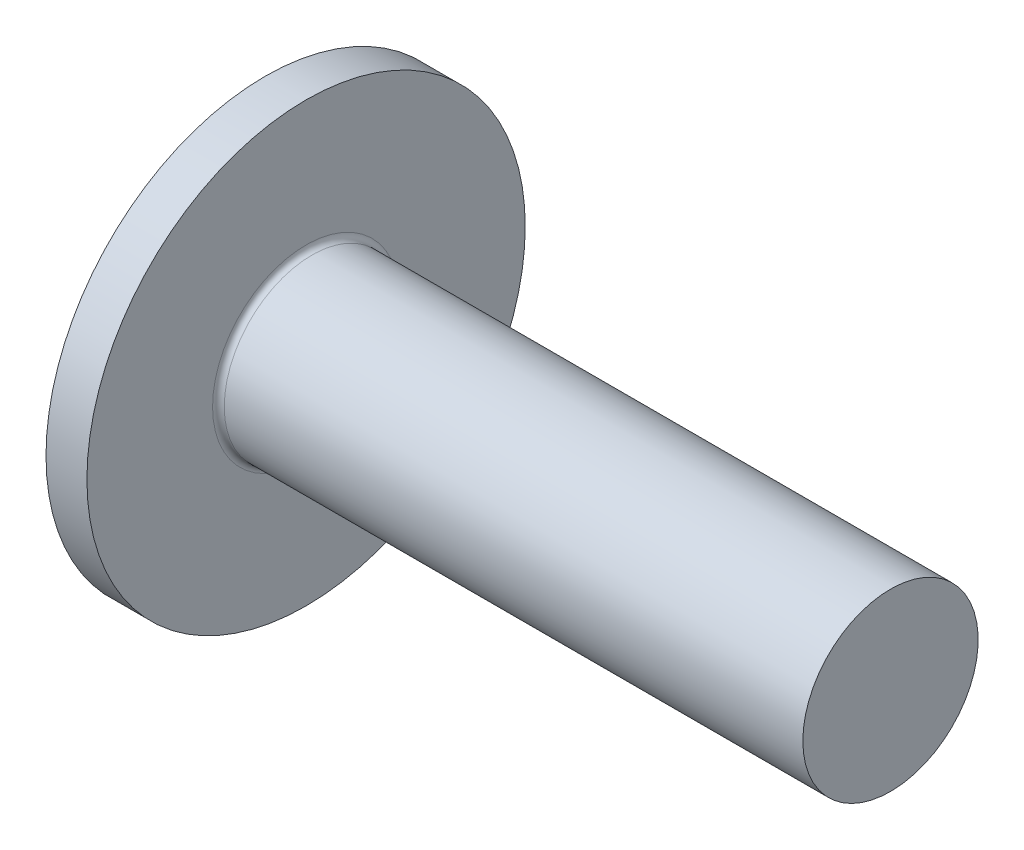
ISO-10303-21;
HEADER;
FILE_DESCRIPTION(('STEP AP214'),'2;1');
FILE_NAME('part.step','',(''),(''),'','','');
FILE_SCHEMA(('AUTOMOTIVE_DESIGN { 1 0 10303 214 1 1 1 1 }'));
ENDSEC;
DATA;
#1=APPLICATION_CONTEXT('core data for automotive mechanical design processes');
#2=APPLICATION_PROTOCOL_DEFINITION('international standard','automotive_design',2000,#1);
#3=PRODUCT_CONTEXT('',#1,'mechanical');
#4=PRODUCT('Part','Part','',(#3));
#5=PRODUCT_RELATED_PRODUCT_CATEGORY('part','',(#4));
#6=PRODUCT_DEFINITION_FORMATION('','',#4);
#7=PRODUCT_DEFINITION_CONTEXT('part definition',#1,'design');
#8=PRODUCT_DEFINITION('design','',#6,#7);
#9=PRODUCT_DEFINITION_SHAPE('','',#8);
#10=(LENGTH_UNIT() NAMED_UNIT(*) SI_UNIT(.MILLI.,.METRE.));
#11=(NAMED_UNIT(*) PLANE_ANGLE_UNIT() SI_UNIT($,.RADIAN.));
#12=(NAMED_UNIT(*) SI_UNIT($,.STERADIAN.) SOLID_ANGLE_UNIT());
#13=UNCERTAINTY_MEASURE_WITH_UNIT(LENGTH_MEASURE(1.E-05),#10,'distance_accuracy_value','');
#14=(GEOMETRIC_REPRESENTATION_CONTEXT(3) GLOBAL_UNCERTAINTY_ASSIGNED_CONTEXT((#13)) GLOBAL_UNIT_ASSIGNED_CONTEXT((#10,
#11,#12)) REPRESENTATION_CONTEXT('',''));
#15=CARTESIAN_POINT('',(0.,0.,0.));
#16=DIRECTION('',(0.,0.,1.));
#17=DIRECTION('',(1.,0.,0.));
#18=AXIS2_PLACEMENT_3D('',#15,#16,#17);
#19=CARTESIAN_POINT('',(1.83,-2.1065246820908,0.37));
#20=DIRECTION('',(0.,0.,1.));
#21=DIRECTION('',(1.,0.,0.));
#22=AXIS2_PLACEMENT_3D('',#19,#20,#21);
#23=PLANE('',#22);
#24=CARTESIAN_POINT('',(-1.32786673493821,-0.897219539779274,0.369999999999999));
#25=CARTESIAN_POINT('',(-1.06109337671331,-0.877038062199218,0.369999999999999));
#26=CARTESIAN_POINT('',(-0.794326989671242,-0.856763698073297,0.369999999999999));
#27=CARTESIAN_POINT('',(-0.260811337761385,-0.815970652270596,0.369999999999999));
#28=CARTESIAN_POINT('',(0.0059379269972715,-0.795451969167194,0.369999999999999));
#29=CARTESIAN_POINT('',(0.539412998487968,-0.754111978403986,0.369999999999999));
#30=CARTESIAN_POINT('',(0.806138805223426,-0.733290670788351,0.37));
#31=CARTESIAN_POINT('',(1.33955859559175,-0.691258233974171,0.37));
#32=CARTESIAN_POINT('',(1.60625257935714,-0.670047106460322,0.37));
#33=CARTESIAN_POINT('',(2.16947783557568,-0.624704906677489,0.37));
#34=CARTESIAN_POINT('',(2.46600421577986,-0.600512950110424,0.37));
#35=CARTESIAN_POINT('',(3.05898099108759,-0.551230034840915,0.37));
#36=CARTESIAN_POINT('',(3.35543138664247,-0.526139081609087,0.37));
#37=CARTESIAN_POINT('',(3.8000230571777,-0.487471420095873,0.370000000000001));
#38=CARTESIAN_POINT('',(3.9482090842122,-0.474410071891181,0.370000000000001));
#39=CARTESIAN_POINT('',(4.24454081077005,-0.447842423983555,0.370000000000001));
#40=CARTESIAN_POINT('',(4.39268651042511,-0.43433612575181,0.370000000000001));
#41=CARTESIAN_POINT('',(4.68892844322179,-0.406748557620104,0.370000000000001));
#42=CARTESIAN_POINT('',(4.83702467507035,-0.392667273720532,0.370000000000001));
#43=CARTESIAN_POINT('',(5.13313852244323,-0.363686294474164,0.370000000000001));
#44=CARTESIAN_POINT('',(5.28115613704917,-0.34878658977029,0.370000000000001));
#45=CARTESIAN_POINT('',(5.42911997966567,-0.333355957600112,0.370000000000001));
#46=B_SPLINE_CURVE_WITH_KNOTS('',3,(#24,#25,#26,#27,#28,#29,#30,#31,#32,#33,#34,#35,#36,#37,#38,
#39,#40,#41,#42,#43,#44,#45),.UNSPECIFIED.,.F.,.F.,(4,2,2,2,2,2,2,2,2,2,4),(0.,
0.802606976261587,1.6052186413846,2.40783018936094,3.21043826948609,4.10297224159249,
4.99550078333373,5.44178186811166,5.88806147744834,6.33435195917925,6.78064754445098),.UNSPECIFIED.);
#47=CARTESIAN_POINT('',(1.83000000000022,-0.65203220416821,0.37));
#48=VERTEX_POINT('',#47);
#49=CARTESIAN_POINT('',(0.101072692651103,-0.788058865154528,0.369999999999999));
#50=VERTEX_POINT('',#49);
#51=EDGE_CURVE('E324',#48,#50,#46,.F.);
#52=ORIENTED_EDGE('',*,*,#51,.F.);
#53=DIRECTION('',(0.,1.,0.));
#54=VECTOR('',#53,1.);
#55=CARTESIAN_POINT('',(1.83,-2.1065246820908,0.37));
#56=LINE('',#55,#54);
#57=CARTESIAN_POINT('',(1.83,-2.1065246820908,0.37));
#58=VERTEX_POINT('',#57);
#59=EDGE_CURVE('E283',#58,#48,#56,.T.);
#60=ORIENTED_EDGE('',*,*,#59,.F.);
#61=DIRECTION('',(0.941259815267089,-0.337683224580915,0.));
#62=VECTOR('',#61,1.);
#63=CARTESIAN_POINT('',(0.,-1.45,0.369999999999999));
#64=LINE('',#63,#62);
#65=CARTESIAN_POINT('',(0.364218312315864,-1.58066574410099,0.369999999999999));
#66=VERTEX_POINT('',#65);
#67=EDGE_CURVE('E269',#66,#58,#64,.T.);
#68=ORIENTED_EDGE('',*,*,#67,.F.);
#69=CARTESIAN_POINT('',(3.8,0.,0.370000000000001));
#70=DIRECTION('',(0.,0.,1.));
#71=DIRECTION('',(1.,0.,0.));
#72=AXIS2_PLACEMENT_3D('',#69,#70,#71);
#73=CIRCLE('',#72,3.78194394458723);
#74=EDGE_CURVE('E207',#50,#66,#73,.T.);
#75=ORIENTED_EDGE('',*,*,#74,.F.);
#76=EDGE_LOOP('',(#52,#60,#68,#75));
#77=FACE_BOUND('',#76,.T.);
#78=ADVANCED_FACE('F33',(#77),#23,.F.);
#79=CARTESIAN_POINT('',(1.83,2.1065246820908,-0.37));
#80=DIRECTION('',(0.,0.,-1.));
#81=DIRECTION('',(-1.,0.,0.));
#82=AXIS2_PLACEMENT_3D('',#79,#80,#81);
#83=PLANE('',#82);
#84=CARTESIAN_POINT('',(-1.32786673493821,-0.897219539779274,-0.37));
#85=CARTESIAN_POINT('',(-1.06109337671331,-0.877038062199217,-0.37));
#86=CARTESIAN_POINT('',(-0.794326989671243,-0.856763698073297,-0.37));
#87=CARTESIAN_POINT('',(-0.260811337761386,-0.815970652270596,-0.37));
#88=CARTESIAN_POINT('',(0.00593792699727101,-0.795451969167194,-0.37));
#89=CARTESIAN_POINT('',(0.539412998487968,-0.754111978403986,-0.37));
#90=CARTESIAN_POINT('',(0.806138805223426,-0.733290670788351,-0.37));
#91=CARTESIAN_POINT('',(1.33955859559175,-0.691258233974171,-0.37));
#92=CARTESIAN_POINT('',(1.60625257935714,-0.670047106460322,-0.370000000000001));
#93=CARTESIAN_POINT('',(2.16947783557568,-0.624704906677489,-0.370000000000001));
#94=CARTESIAN_POINT('',(2.46600421577987,-0.600512950110424,-0.370000000000001));
#95=CARTESIAN_POINT('',(3.05898099108759,-0.551230034840915,-0.370000000000001));
#96=CARTESIAN_POINT('',(3.35543138664247,-0.526139081609087,-0.370000000000001));
#97=CARTESIAN_POINT('',(3.80002305717771,-0.487471420095872,-0.370000000000001));
#98=CARTESIAN_POINT('',(3.9482090842122,-0.47441007189118,-0.370000000000001));
#99=CARTESIAN_POINT('',(4.24454081077005,-0.447842423983555,-0.370000000000001));
#100=CARTESIAN_POINT('',(4.39268651042512,-0.434336125751809,-0.370000000000001));
#101=CARTESIAN_POINT('',(4.68892844322179,-0.406748557620104,-0.370000000000001));
#102=CARTESIAN_POINT('',(4.83702467507035,-0.392667273720532,-0.370000000000001));
#103=CARTESIAN_POINT('',(5.13313852244323,-0.363686294474163,-0.370000000000001));
#104=CARTESIAN_POINT('',(5.28115613704917,-0.348786589770289,-0.370000000000001));
#105=CARTESIAN_POINT('',(5.42911997966567,-0.333355957600112,-0.370000000000001));
#106=B_SPLINE_CURVE_WITH_KNOTS('',3,(#84,#85,#86,#87,#88,#89,#90,#91,#92,#93,#94,#95,#96,#97,
#98,#99,#100,#101,#102,#103,#104,#105),.UNSPECIFIED.,.F.,.F.,(4,2,2,2,2,2,2,2,2,2,4),(0.,
0.802606976261587,1.6052186413846,2.40783018936094,3.21043826948609,4.1029722415925,
4.99550078333373,5.44178186811167,5.88806147744834,6.33435195917925,6.78064754445099),.UNSPECIFIED.);
#107=CARTESIAN_POINT('',(0.101072692651104,-0.788058865154531,-0.37));
#108=VERTEX_POINT('',#107);
#109=CARTESIAN_POINT('',(1.83,-0.652032204167295,-0.370000000000001));
#110=VERTEX_POINT('',#109);
#111=EDGE_CURVE('E316',#108,#110,#106,.T.);
#112=ORIENTED_EDGE('',*,*,#111,.F.);
#113=CARTESIAN_POINT('',(3.8,0.,-0.370000000000001));
#114=DIRECTION('',(0.,0.,-1.));
#115=DIRECTION('',(-1.,0.,0.));
#116=AXIS2_PLACEMENT_3D('',#113,#114,#115);
#117=CIRCLE('',#116,3.78194394458723);
#118=CARTESIAN_POINT('',(0.364218312315864,-1.58066574410099,-0.37));
#119=VERTEX_POINT('',#118);
#120=EDGE_CURVE('E212',#119,#108,#117,.T.);
#121=ORIENTED_EDGE('',*,*,#120,.F.);
#122=DIRECTION('',(0.941259815267089,-0.337683224580915,0.));
#123=VECTOR('',#122,1.);
#124=CARTESIAN_POINT('',(0.,-1.45,-0.37));
#125=LINE('',#124,#123);
#126=CARTESIAN_POINT('',(1.83,-2.1065246820908,-0.370000000000001));
#127=VERTEX_POINT('',#126);
#128=EDGE_CURVE('E272',#119,#127,#125,.T.);
#129=ORIENTED_EDGE('',*,*,#128,.T.);
#130=DIRECTION('',(0.,-1.,0.));
#131=VECTOR('',#130,1.);
#132=CARTESIAN_POINT('',(1.83,2.1065246820908,-0.37));
#133=LINE('',#132,#131);
#134=EDGE_CURVE('E282',#110,#127,#133,.T.);
#135=ORIENTED_EDGE('',*,*,#134,.F.);
#136=EDGE_LOOP('',(#112,#121,#129,#135));
#137=FACE_BOUND('',#136,.T.);
#138=ADVANCED_FACE('F165',(#137),#83,.F.);
#139=CARTESIAN_POINT('',(3.8,0.,0.));
#140=DIRECTION('',(-1.,0.,0.));
#141=DIRECTION('',(0.,1.,0.));
#142=AXIS2_PLACEMENT_3D('',#139,#140,#141);
#143=SPHERICAL_SURFACE('',#142,3.8);
#144=CARTESIAN_POINT('',(1.65,0.,0.));
#145=DIRECTION('',(1.,0.,0.));
#146=DIRECTION('',(0.,0.,-1.));
#147=AXIS2_PLACEMENT_3D('',#144,#145,#146);
#148=CIRCLE('',#147,3.13328900677866);
#149=CARTESIAN_POINT('',(1.65,0.,-3.13328900677866));
#150=VERTEX_POINT('',#149);
#151=EDGE_CURVE('E305',#150,#150,#148,.F.);
#152=ORIENTED_EDGE('',*,*,#151,.T.);
#153=EDGE_LOOP('',(#152));
#154=FACE_BOUND('',#153,.T.);
#155=CARTESIAN_POINT('',(0.101072692651103,0.,0.));
#156=DIRECTION('',(1.,0.,0.));
#157=DIRECTION('',(0.,0.,-1.));
#158=AXIS2_PLACEMENT_3D('',#155,#156,#157);
#159=CIRCLE('',#158,0.870595643768476);
#160=CARTESIAN_POINT('',(0.101072692651103,-0.369999999999996,-0.788058865154528));
#161=VERTEX_POINT('',#160);
#162=EDGE_CURVE('E310',#161,#108,#159,.F.);
#163=ORIENTED_EDGE('',*,*,#162,.F.);
#164=CARTESIAN_POINT('',(3.8,-0.370000000000001,0.));
#165=DIRECTION('',(0.,-1.,0.));
#166=DIRECTION('',(0.,0.,-1.));
#167=AXIS2_PLACEMENT_3D('',#164,#165,#166);
#168=CIRCLE('',#167,3.78194394458723);
#169=CARTESIAN_POINT('',(0.364218312315864,-0.369999999999994,-1.580665744101));
#170=VERTEX_POINT('',#169);
#171=EDGE_CURVE('E223',#161,#170,#168,.T.);
#172=ORIENTED_EDGE('',*,*,#171,.T.);
#173=CARTESIAN_POINT('',(2.90580705947686,0.,-2.49247762619686));
#174=DIRECTION('',(-0.337683224580915,0.,-0.94125981526709));
#175=DIRECTION('',(-0.94125981526709,0.,0.337683224580915));
#176=AXIS2_PLACEMENT_3D('',#173,#174,#175);
#177=CIRCLE('',#176,2.72543102426509);
#178=CARTESIAN_POINT('',(0.364218312315864,0.370000000000006,-1.58066574410099));
#179=VERTEX_POINT('',#178);
#180=EDGE_CURVE('E46',#170,#179,#177,.T.);
#181=ORIENTED_EDGE('',*,*,#180,.T.);
#182=CARTESIAN_POINT('',(3.8,0.370000000000001,0.));
#183=DIRECTION('',(0.,1.,0.));
#184=DIRECTION('',(0.,0.,1.));
#185=AXIS2_PLACEMENT_3D('',#182,#183,#184);
#186=CIRCLE('',#185,3.78194394458723);
#187=CARTESIAN_POINT('',(0.101072692651103,0.370000000000003,-0.788058865154526));
#188=VERTEX_POINT('',#187);
#189=EDGE_CURVE('E221',#179,#188,#186,.T.);
#190=ORIENTED_EDGE('',*,*,#189,.T.);
#191=CARTESIAN_POINT('',(0.101072692651104,0.788058865154531,-0.37));
#192=VERTEX_POINT('',#191);
#193=EDGE_CURVE('E331',#192,#188,#159,.F.);
#194=ORIENTED_EDGE('',*,*,#193,.F.);
#195=CARTESIAN_POINT('',(0.364218312315865,1.580665744101,-0.37));
#196=VERTEX_POINT('',#195);
#197=EDGE_CURVE('E307',#192,#196,#117,.T.);
#198=ORIENTED_EDGE('',*,*,#197,.T.);
#199=CARTESIAN_POINT('',(2.90580705947687,2.49247762619686,0.));
#200=DIRECTION('',(-0.337683224580915,0.941259815267089,0.));
#201=DIRECTION('',(-0.941259815267089,-0.337683224580915,0.));
#202=AXIS2_PLACEMENT_3D('',#199,#200,#201);
#203=CIRCLE('',#202,2.72543102426509);
#204=CARTESIAN_POINT('',(0.364218312315865,1.580665744101,0.369999999999999));
#205=VERTEX_POINT('',#204);
#206=EDGE_CURVE('E205',#196,#205,#203,.T.);
#207=ORIENTED_EDGE('',*,*,#206,.T.);
#208=CARTESIAN_POINT('',(0.101072692651103,0.788058865154528,0.369999999999999));
#209=VERTEX_POINT('',#208);
#210=EDGE_CURVE('E193',#205,#209,#73,.T.);
#211=ORIENTED_EDGE('',*,*,#210,.T.);
#212=CARTESIAN_POINT('',(0.101072692651105,0.369999999999997,0.788058865154532));
#213=VERTEX_POINT('',#212);
#214=EDGE_CURVE('E203',#213,#209,#159,.F.);
#215=ORIENTED_EDGE('',*,*,#214,.F.);
#216=CARTESIAN_POINT('',(0.364218312315865,0.369999999999994,1.580665744101));
#217=VERTEX_POINT('',#216);
#218=EDGE_CURVE('E240',#213,#217,#186,.T.);
#219=ORIENTED_EDGE('',*,*,#218,.T.);
#220=CARTESIAN_POINT('',(2.90580705947687,0.,2.49247762619686));
#221=DIRECTION('',(-0.337683224580915,0.,0.941259815267089));
#222=DIRECTION('',(0.941259815267089,0.,0.337683224580915));
#223=AXIS2_PLACEMENT_3D('',#220,#221,#222);
#224=CIRCLE('',#223,2.72543102426509);
#225=CARTESIAN_POINT('',(0.364218312315865,-0.370000000000005,1.58066574410099));
#226=VERTEX_POINT('',#225);
#227=EDGE_CURVE('E210',#217,#226,#224,.T.);
#228=ORIENTED_EDGE('',*,*,#227,.T.);
#229=CARTESIAN_POINT('',(0.101072692651104,-0.370000000000002,0.78805886515453));
#230=VERTEX_POINT('',#229);
#231=EDGE_CURVE('E268',#226,#230,#168,.T.);
#232=ORIENTED_EDGE('',*,*,#231,.T.);
#233=EDGE_CURVE('E197',#50,#230,#159,.F.);
#234=ORIENTED_EDGE('',*,*,#233,.F.);
#235=ORIENTED_EDGE('',*,*,#74,.T.);
#236=CARTESIAN_POINT('',(2.90580705947686,-2.49247762619686,0.));
#237=DIRECTION('',(-0.337683224580915,-0.94125981526709,0.));
#238=DIRECTION('',(0.94125981526709,-0.337683224580915,0.));
#239=AXIS2_PLACEMENT_3D('',#236,#237,#238);
#240=CIRCLE('',#239,2.72543102426508);
#241=EDGE_CURVE('E206',#66,#119,#240,.T.);
#242=ORIENTED_EDGE('',*,*,#241,.T.);
#243=ORIENTED_EDGE('',*,*,#120,.T.);
#244=EDGE_LOOP('',(#163,#172,#181,#190,#194,#198,#207,#211,#215,#219,#228,#232,#234,#235,#242,#243));
#245=FACE_BOUND('',#244,.T.);
#246=ADVANCED_FACE('F172',(#154,#245),#143,.T.);
#247=CARTESIAN_POINT('',(-1.32786673493863,0.897219539779306,0.369999999999999));
#248=CARTESIAN_POINT('',(-1.06109337671372,0.877038062199249,0.369999999999999));
#249=CARTESIAN_POINT('',(-0.794326989671651,0.856763698073328,0.369999999999999));
#250=CARTESIAN_POINT('',(-0.260811337761783,0.815970652270626,0.369999999999999));
#251=CARTESIAN_POINT('',(0.00593792699687864,0.795451969167224,0.369999999999999));
#252=CARTESIAN_POINT('',(0.539412998487585,0.754111978404016,0.369999999999999));
#253=CARTESIAN_POINT('',(0.806138805223046,0.733290670788381,0.37));
#254=CARTESIAN_POINT('',(1.33955859559138,0.691258233974201,0.37));
#255=CARTESIAN_POINT('',(1.60625257935677,0.670047106460351,0.37));
#256=CARTESIAN_POINT('',(2.16947783557532,0.624704906677519,0.37));
#257=CARTESIAN_POINT('',(2.4660042157795,0.600512950110454,0.37));
#258=CARTESIAN_POINT('',(3.05898099108723,0.551230034840946,0.37));
#259=CARTESIAN_POINT('',(3.35543138664211,0.526139081609118,0.37));
#260=CARTESIAN_POINT('',(3.80002305717734,0.487471420095904,0.370000000000001));
#261=CARTESIAN_POINT('',(3.94820908421184,0.474410071891213,0.370000000000001));
#262=CARTESIAN_POINT('',(4.24454081076969,0.447842423983588,0.370000000000001));
#263=CARTESIAN_POINT('',(4.39268651042475,0.434336125751843,0.370000000000001));
#264=CARTESIAN_POINT('',(4.68892844322142,0.406748557620138,0.370000000000001));
#265=CARTESIAN_POINT('',(4.83702467506999,0.392667273720567,0.370000000000001));
#266=CARTESIAN_POINT('',(5.13313852244287,0.3636862944742,0.370000000000001));
#267=CARTESIAN_POINT('',(5.28115613704881,0.348786589770327,0.370000000000001));
#268=CARTESIAN_POINT('',(5.42911997966531,0.33335595760015,0.370000000000001));
#269=B_SPLINE_CURVE_WITH_KNOTS('',3,(#247,#248,#249,#250,#251,#252,#253,#254,#255,#256,#257,
#258,#259,#260,#261,#262,#263,#264,#265,#266,#267,#268),.UNSPECIFIED.,.F.,.F.,(4,2,2,2,2,2,2,2,
2,2,4),(0.,0.802606976261603,1.60521864138463,2.40783018936098,3.21043826948614,
4.10297224159255,4.99550078333379,5.44178186811172,5.88806147744839,6.33435195917931,
6.78064754445104),.UNSPECIFIED.);
#270=CARTESIAN_POINT('',(1.83000000000022,0.65203220416821,0.37));
#271=VERTEX_POINT('',#270);
#272=EDGE_CURVE('E191',#209,#271,#269,.T.);
#273=ORIENTED_EDGE('',*,*,#272,.F.);
#274=ORIENTED_EDGE('',*,*,#210,.F.);
#275=DIRECTION('',(0.941259815267089,0.337683224580915,0.));
#276=VECTOR('',#275,1.);
#277=CARTESIAN_POINT('',(0.,1.45,0.369999999999999));
#278=LINE('',#277,#276);
#279=CARTESIAN_POINT('',(1.83,2.1065246820908,0.37));
#280=VERTEX_POINT('',#279);
#281=EDGE_CURVE('E60',#205,#280,#278,.T.);
#282=ORIENTED_EDGE('',*,*,#281,.T.);
#283=EDGE_CURVE('E195',#271,#280,#56,.T.);
#284=ORIENTED_EDGE('',*,*,#283,.F.);
#285=EDGE_LOOP('',(#273,#274,#282,#284));
#286=FACE_BOUND('',#285,.T.);
#287=ADVANCED_FACE('F168',(#286),#23,.F.);
#288=CARTESIAN_POINT('',(-1.32786673493863,0.897219539779306,-0.37));
#289=CARTESIAN_POINT('',(-1.06109337671372,0.877038062199249,-0.37));
#290=CARTESIAN_POINT('',(-0.79432698967165,0.856763698073328,-0.37));
#291=CARTESIAN_POINT('',(-0.260811337761783,0.815970652270626,-0.37));
#292=CARTESIAN_POINT('',(0.00593792699687907,0.795451969167224,-0.37));
#293=CARTESIAN_POINT('',(0.539412998487585,0.754111978404016,-0.37));
#294=CARTESIAN_POINT('',(0.806138805223047,0.73329067078838,-0.37));
#295=CARTESIAN_POINT('',(1.33955859559138,0.6912582339742,-0.37));
#296=CARTESIAN_POINT('',(1.60625257935677,0.670047106460351,-0.37));
#297=CARTESIAN_POINT('',(2.16947783557532,0.624704906677519,-0.37));
#298=CARTESIAN_POINT('',(2.4660042157795,0.600512950110454,-0.370000000000001));
#299=CARTESIAN_POINT('',(3.05898099108723,0.551230034840946,-0.370000000000001));
#300=CARTESIAN_POINT('',(3.3554313866421,0.526139081609118,-0.370000000000001));
#301=CARTESIAN_POINT('',(3.80002305717734,0.487471420095904,-0.370000000000001));
#302=CARTESIAN_POINT('',(3.94820908421183,0.474410071891213,-0.370000000000001));
#303=CARTESIAN_POINT('',(4.24454081076968,0.447842423983588,-0.370000000000001));
#304=CARTESIAN_POINT('',(4.39268651042475,0.434336125751843,-0.370000000000001));
#305=CARTESIAN_POINT('',(4.68892844322142,0.406748557620138,-0.370000000000001));
#306=CARTESIAN_POINT('',(4.83702467506998,0.392667273720567,-0.370000000000001));
#307=CARTESIAN_POINT('',(5.13313852244286,0.3636862944742,-0.370000000000001));
#308=CARTESIAN_POINT('',(5.28115613704881,0.348786589770327,-0.370000000000001));
#309=CARTESIAN_POINT('',(5.42911997966531,0.33335595760015,-0.370000000000001));
#310=B_SPLINE_CURVE_WITH_KNOTS('',3,(#288,#289,#290,#291,#292,#293,#294,#295,#296,#297,#298,
#299,#300,#301,#302,#303,#304,#305,#306,#307,#308,#309),.UNSPECIFIED.,.F.,.F.,(4,2,2,2,2,2,2,2,
2,2,4),(0.,0.802606976261603,1.60521864138463,2.40783018936098,3.21043826948614,
4.10297224159255,4.99550078333379,5.44178186811172,5.88806147744839,6.3343519591793,
6.78064754445104),.UNSPECIFIED.);
#311=CARTESIAN_POINT('',(1.83,0.652032204167295,-0.37));
#312=VERTEX_POINT('',#311);
#313=EDGE_CURVE('E340',#312,#192,#310,.F.);
#314=ORIENTED_EDGE('',*,*,#313,.F.);
#315=CARTESIAN_POINT('',(1.83,2.1065246820908,-0.37));
#316=VERTEX_POINT('',#315);
#317=EDGE_CURVE('E284',#316,#312,#133,.T.);
#318=ORIENTED_EDGE('',*,*,#317,.F.);
#319=DIRECTION('',(0.941259815267089,0.337683224580915,0.));
#320=VECTOR('',#319,1.);
#321=CARTESIAN_POINT('',(0.,1.45,-0.37));
#322=LINE('',#321,#320);
#323=EDGE_CURVE('E276',#196,#316,#322,.T.);
#324=ORIENTED_EDGE('',*,*,#323,.F.);
#325=ORIENTED_EDGE('',*,*,#197,.F.);
#326=EDGE_LOOP('',(#314,#318,#324,#325));
#327=FACE_BOUND('',#326,.T.);
#328=ADVANCED_FACE('F175',(#327),#83,.F.);
#329=CARTESIAN_POINT('',(1.83,-2.1065246820908,0.37));
#330=DIRECTION('',(1.,0.,0.));
#331=DIRECTION('',(0.,0.,-1.));
#332=AXIS2_PLACEMENT_3D('',#329,#330,#331);
#333=PLANE('',#332);
#334=CARTESIAN_POINT('',(1.83,0.,0.));
#335=DIRECTION('',(1.,0.,0.));
#336=DIRECTION('',(0.,0.,-1.));
#337=AXIS2_PLACEMENT_3D('',#334,#335,#336);
#338=CIRCLE('',#337,0.749697269083503);
#339=EDGE_CURVE('E328',#110,#48,#338,.F.);
#340=ORIENTED_EDGE('',*,*,#339,.F.);
#341=ORIENTED_EDGE('',*,*,#134,.T.);
#342=DIRECTION('',(0.,0.,1.));
#343=VECTOR('',#342,1.);
#344=CARTESIAN_POINT('',(1.83,-2.1065246820908,-0.370000000000001));
#345=LINE('',#344,#343);
#346=EDGE_CURVE('E278',#127,#58,#345,.T.);
#347=ORIENTED_EDGE('',*,*,#346,.T.);
#348=ORIENTED_EDGE('',*,*,#59,.T.);
#349=EDGE_LOOP('',(#340,#341,#347,#348));
#350=FACE_BOUND('',#349,.T.);
#351=ADVANCED_FACE('F185',(#350),#333,.F.);
#352=CARTESIAN_POINT('',(1.83,-0.370000000000002,0.652032204167294));
#353=VERTEX_POINT('',#352);
#354=CARTESIAN_POINT('',(1.83,0.369999999999998,0.652032204167297));
#355=VERTEX_POINT('',#354);
#356=EDGE_CURVE('E52',#353,#355,#338,.F.);
#357=ORIENTED_EDGE('',*,*,#356,.F.);
#358=DIRECTION('',(0.,0.,1.));
#359=VECTOR('',#358,1.);
#360=CARTESIAN_POINT('',(1.83,-0.369999999999993,-2.1065246820908));
#361=LINE('',#360,#359);
#362=CARTESIAN_POINT('',(1.83,-0.370000000000007,2.1065246820908));
#363=VERTEX_POINT('',#362);
#364=EDGE_CURVE('E265',#353,#363,#361,.T.);
#365=ORIENTED_EDGE('',*,*,#364,.T.);
#366=DIRECTION('',(0.,1.,0.));
#367=VECTOR('',#366,1.);
#368=CARTESIAN_POINT('',(1.83,-0.370000000000007,2.1065246820908));
#369=LINE('',#368,#367);
#370=CARTESIAN_POINT('',(1.83,0.369999999999993,2.1065246820908));
#371=VERTEX_POINT('',#370);
#372=EDGE_CURVE('E257',#363,#371,#369,.T.);
#373=ORIENTED_EDGE('',*,*,#372,.T.);
#374=DIRECTION('',(0.,0.,-1.));
#375=VECTOR('',#374,1.);
#376=CARTESIAN_POINT('',(1.83,0.369999999999993,2.1065246820908));
#377=LINE('',#376,#375);
#378=EDGE_CURVE('E261',#371,#355,#377,.T.);
#379=ORIENTED_EDGE('',*,*,#378,.T.);
#380=EDGE_LOOP('',(#357,#365,#373,#379));
#381=FACE_BOUND('',#380,.T.);
#382=ADVANCED_FACE('F428',(#381),#333,.F.);
#383=EDGE_CURVE('E326',#271,#312,#338,.F.);
#384=ORIENTED_EDGE('',*,*,#383,.F.);
#385=ORIENTED_EDGE('',*,*,#283,.T.);
#386=DIRECTION('',(0.,0.,-1.));
#387=VECTOR('',#386,1.);
#388=CARTESIAN_POINT('',(1.83,2.1065246820908,0.37));
#389=LINE('',#388,#387);
#390=EDGE_CURVE('E279',#280,#316,#389,.T.);
#391=ORIENTED_EDGE('',*,*,#390,.T.);
#392=ORIENTED_EDGE('',*,*,#317,.T.);
#393=EDGE_LOOP('',(#384,#385,#391,#392));
#394=FACE_BOUND('',#393,.T.);
#395=ADVANCED_FACE('F436',(#394),#333,.F.);
#396=CARTESIAN_POINT('',(1.83,-0.369999999999993,-2.1065246820908));
#397=DIRECTION('',(0.,-1.,0.));
#398=DIRECTION('',(1.,0.,0.));
#399=AXIS2_PLACEMENT_3D('',#396,#397,#398);
#400=PLANE('',#399);
#401=CARTESIAN_POINT('',(-1.32786673493863,-0.369999999999996,-0.897219539779307));
#402=CARTESIAN_POINT('',(-1.06109337671372,-0.369999999999996,-0.87703806219925));
#403=CARTESIAN_POINT('',(-0.794326989671652,-0.369999999999996,-0.85676369807333));
#404=CARTESIAN_POINT('',(-0.260811337761784,-0.369999999999996,-0.815970652270628));
#405=CARTESIAN_POINT('',(0.00593792699687848,-0.369999999999996,-0.795451969167226));
#406=CARTESIAN_POINT('',(0.539412998487585,-0.369999999999997,-0.754111978404018));
#407=CARTESIAN_POINT('',(0.806138805223046,-0.369999999999997,-0.733290670788382));
#408=CARTESIAN_POINT('',(1.33955859559138,-0.369999999999997,-0.691258233974202));
#409=CARTESIAN_POINT('',(1.60625257935677,-0.369999999999997,-0.670047106460353));
#410=CARTESIAN_POINT('',(2.16947783557532,-0.369999999999998,-0.624704906677521));
#411=CARTESIAN_POINT('',(2.4660042157795,-0.369999999999998,-0.600512950110455));
#412=CARTESIAN_POINT('',(3.05898099108723,-0.369999999999998,-0.551230034840947));
#413=CARTESIAN_POINT('',(3.3554313866421,-0.369999999999999,-0.526139081609119));
#414=CARTESIAN_POINT('',(3.80002305717734,-0.369999999999999,-0.487471420095906));
#415=CARTESIAN_POINT('',(3.94820908421183,-0.369999999999999,-0.474410071891214));
#416=CARTESIAN_POINT('',(4.24454081076968,-0.369999999999999,-0.447842423983589));
#417=CARTESIAN_POINT('',(4.39268651042475,-0.369999999999999,-0.434336125751844));
#418=CARTESIAN_POINT('',(4.68892844322142,-0.37,-0.40674855762014));
#419=CARTESIAN_POINT('',(4.83702467506998,-0.37,-0.392667273720568));
#420=CARTESIAN_POINT('',(5.13313852244286,-0.37,-0.363686294474201));
#421=CARTESIAN_POINT('',(5.28115613704881,-0.37,-0.348786589770328));
#422=CARTESIAN_POINT('',(5.42911997966531,-0.37,-0.333355957600151));
#423=B_SPLINE_CURVE_WITH_KNOTS('',3,(#401,#402,#403,#404,#405,#406,#407,#408,#409,#410,#411,
#412,#413,#414,#415,#416,#417,#418,#419,#420,#421,#422),.UNSPECIFIED.,.F.,.F.,(4,2,2,2,2,2,2,2,
2,2,4),(0.,0.802606976261603,1.60521864138463,2.40783018936098,3.21043826948614,
4.10297224159255,4.99550078333379,5.44178186811172,5.88806147744839,6.3343519591793,
6.78064754445104),.UNSPECIFIED.);
#424=CARTESIAN_POINT('',(1.83,-0.369999999999998,-0.652032204167297));
#425=VERTEX_POINT('',#424);
#426=EDGE_CURVE('E245',#425,#161,#423,.F.);
#427=ORIENTED_EDGE('',*,*,#426,.F.);
#428=CARTESIAN_POINT('',(1.83,-0.369999999999993,-2.1065246820908));
#429=VERTEX_POINT('',#428);
#430=EDGE_CURVE('E238',#429,#425,#361,.T.);
#431=ORIENTED_EDGE('',*,*,#430,.F.);
#432=DIRECTION('',(0.941259815267089,0.,-0.337683224580915));
#433=VECTOR('',#432,1.);
#434=CARTESIAN_POINT('',(0.,-0.369999999999994,-1.45));
#435=LINE('',#434,#433);
#436=EDGE_CURVE('E229',#170,#429,#435,.T.);
#437=ORIENTED_EDGE('',*,*,#436,.F.);
#438=ORIENTED_EDGE('',*,*,#171,.F.);
#439=EDGE_LOOP('',(#427,#431,#437,#438));
#440=FACE_BOUND('',#439,.T.);
#441=ADVANCED_FACE('F236',(#440),#400,.F.);
#442=CARTESIAN_POINT('',(1.83,0.369999999999993,2.1065246820908));
#443=DIRECTION('',(0.,1.,0.));
#444=DIRECTION('',(-1.,0.,0.));
#445=AXIS2_PLACEMENT_3D('',#442,#443,#444);
#446=PLANE('',#445);
#447=CARTESIAN_POINT('',(-1.32786673493863,0.370000000000003,-0.897219539779304));
#448=CARTESIAN_POINT('',(-1.06109337671372,0.370000000000003,-0.877038062199247));
#449=CARTESIAN_POINT('',(-0.794326989671651,0.370000000000003,-0.856763698073327));
#450=CARTESIAN_POINT('',(-0.260811337761784,0.370000000000003,-0.815970652270625));
#451=CARTESIAN_POINT('',(0.00593792699687859,0.370000000000003,-0.795451969167223));
#452=CARTESIAN_POINT('',(0.539412998487585,0.370000000000003,-0.754111978404015));
#453=CARTESIAN_POINT('',(0.806138805223047,0.370000000000003,-0.733290670788379));
#454=CARTESIAN_POINT('',(1.33955859559138,0.370000000000003,-0.691258233974199));
#455=CARTESIAN_POINT('',(1.60625257935677,0.370000000000003,-0.67004710646035));
#456=CARTESIAN_POINT('',(2.16947783557532,0.370000000000003,-0.624704906677518));
#457=CARTESIAN_POINT('',(2.4660042157795,0.370000000000003,-0.600512950110452));
#458=CARTESIAN_POINT('',(3.05898099108723,0.370000000000003,-0.551230034840945));
#459=CARTESIAN_POINT('',(3.3554313866421,0.370000000000003,-0.526139081609117));
#460=CARTESIAN_POINT('',(3.80002305717734,0.370000000000003,-0.487471420095903));
#461=CARTESIAN_POINT('',(3.94820908421183,0.370000000000003,-0.474410071891211));
#462=CARTESIAN_POINT('',(4.24454081076968,0.370000000000003,-0.447842423983587));
#463=CARTESIAN_POINT('',(4.39268651042475,0.370000000000003,-0.434336125751842));
#464=CARTESIAN_POINT('',(4.68892844322142,0.370000000000003,-0.406748557620137));
#465=CARTESIAN_POINT('',(4.83702467506998,0.370000000000003,-0.392667273720566));
#466=CARTESIAN_POINT('',(5.13313852244286,0.370000000000003,-0.363686294474199));
#467=CARTESIAN_POINT('',(5.28115613704881,0.370000000000002,-0.348786589770325));
#468=CARTESIAN_POINT('',(5.42911997966531,0.370000000000002,-0.333355957600149));
#469=B_SPLINE_CURVE_WITH_KNOTS('',3,(#447,#448,#449,#450,#451,#452,#453,#454,#455,#456,#457,
#458,#459,#460,#461,#462,#463,#464,#465,#466,#467,#468),.UNSPECIFIED.,.F.,.F.,(4,2,2,2,2,2,2,2,
2,2,4),(0.,0.802606976261602,1.60521864138463,2.40783018936098,3.21043826948614,
4.10297224159255,4.99550078333379,5.44178186811172,5.88806147744839,6.3343519591793,
6.78064754445104),.UNSPECIFIED.);
#470=CARTESIAN_POINT('',(1.83000000000022,0.370000000000003,-0.652032204168208));
#471=VERTEX_POINT('',#470);
#472=EDGE_CURVE('E360',#188,#471,#469,.T.);
#473=ORIENTED_EDGE('',*,*,#472,.F.);
#474=ORIENTED_EDGE('',*,*,#189,.F.);
#475=DIRECTION('',(0.941259815267089,0.,-0.337683224580915));
#476=VECTOR('',#475,1.);
#477=CARTESIAN_POINT('',(0.,0.370000000000005,-1.45));
#478=LINE('',#477,#476);
#479=CARTESIAN_POINT('',(1.83,0.370000000000008,-2.1065246820908));
#480=VERTEX_POINT('',#479);
#481=EDGE_CURVE('E232',#179,#480,#478,.T.);
#482=ORIENTED_EDGE('',*,*,#481,.T.);
#483=EDGE_CURVE('E260',#471,#480,#377,.T.);
#484=ORIENTED_EDGE('',*,*,#483,.F.);
#485=EDGE_LOOP('',(#473,#474,#482,#484));
#486=FACE_BOUND('',#485,.T.);
#487=ADVANCED_FACE('F365',(#486),#446,.F.);
#488=CARTESIAN_POINT('',(-1.32786673493821,-0.370000000000002,0.897219539779273));
#489=CARTESIAN_POINT('',(-1.06109337671331,-0.370000000000002,0.877038062199216));
#490=CARTESIAN_POINT('',(-0.794326989671242,-0.370000000000002,0.856763698073296));
#491=CARTESIAN_POINT('',(-0.260811337761385,-0.370000000000002,0.815970652270595));
#492=CARTESIAN_POINT('',(0.0059379269972715,-0.370000000000002,0.795451969167193));
#493=CARTESIAN_POINT('',(0.539412998487968,-0.370000000000002,0.754111978403985));
#494=CARTESIAN_POINT('',(0.806138805223426,-0.370000000000002,0.73329067078835));
#495=CARTESIAN_POINT('',(1.33955859559175,-0.370000000000002,0.69125823397417));
#496=CARTESIAN_POINT('',(1.60625257935714,-0.370000000000002,0.670047106460321));
#497=CARTESIAN_POINT('',(2.16947783557568,-0.370000000000002,0.624704906677488));
#498=CARTESIAN_POINT('',(2.46600421577986,-0.370000000000002,0.600512950110423));
#499=CARTESIAN_POINT('',(3.05898099108759,-0.370000000000002,0.551230034840914));
#500=CARTESIAN_POINT('',(3.35543138664247,-0.370000000000002,0.526139081609086));
#501=CARTESIAN_POINT('',(3.8000230571777,-0.370000000000002,0.487471420095871));
#502=CARTESIAN_POINT('',(3.9482090842122,-0.370000000000002,0.474410071891179));
#503=CARTESIAN_POINT('',(4.24454081077005,-0.370000000000002,0.447842423983554));
#504=CARTESIAN_POINT('',(4.39268651042511,-0.370000000000002,0.434336125751808));
#505=CARTESIAN_POINT('',(4.68892844322179,-0.370000000000002,0.406748557620103));
#506=CARTESIAN_POINT('',(4.83702467507035,-0.370000000000002,0.392667273720531));
#507=CARTESIAN_POINT('',(5.13313852244323,-0.370000000000002,0.363686294474162));
#508=CARTESIAN_POINT('',(5.28115613704917,-0.370000000000002,0.348786589770288));
#509=CARTESIAN_POINT('',(5.42911997966567,-0.370000000000002,0.333355957600111));
#510=B_SPLINE_CURVE_WITH_KNOTS('',3,(#488,#489,#490,#491,#492,#493,#494,#495,#496,#497,#498,
#499,#500,#501,#502,#503,#504,#505,#506,#507,#508,#509),.UNSPECIFIED.,.F.,.F.,(4,2,2,2,2,2,2,2,
2,2,4),(0.,0.802606976261587,1.6052186413846,2.40783018936094,3.21043826948609,4.10297224159249,
4.99550078333373,5.44178186811166,5.88806147744834,6.33435195917925,6.78064754445098),.UNSPECIFIED.);
#511=EDGE_CURVE('E198',#230,#353,#510,.T.);
#512=ORIENTED_EDGE('',*,*,#511,.F.);
#513=ORIENTED_EDGE('',*,*,#231,.F.);
#514=DIRECTION('',(0.941259815267089,0.,0.337683224580915));
#515=VECTOR('',#514,1.);
#516=CARTESIAN_POINT('',(0.,-0.370000000000004,1.45));
#517=LINE('',#516,#515);
#518=EDGE_CURVE('E242',#226,#363,#517,.T.);
#519=ORIENTED_EDGE('',*,*,#518,.T.);
#520=ORIENTED_EDGE('',*,*,#364,.F.);
#521=EDGE_LOOP('',(#512,#513,#519,#520));
#522=FACE_BOUND('',#521,.T.);
#523=ADVANCED_FACE('F369',(#522),#400,.F.);
#524=CARTESIAN_POINT('',(-1.32786673493824,0.369999999999996,0.897219539779277));
#525=CARTESIAN_POINT('',(-1.06109337671333,0.369999999999997,0.87703806219922));
#526=CARTESIAN_POINT('',(-0.794326989671262,0.369999999999997,0.856763698073299));
#527=CARTESIAN_POINT('',(-0.260811337761397,0.369999999999997,0.815970652270598));
#528=CARTESIAN_POINT('',(0.00593792699726299,0.369999999999997,0.795451969167196));
#529=CARTESIAN_POINT('',(0.539412998487969,0.369999999999997,0.754111978403987));
#530=CARTESIAN_POINT('',(0.806138805223432,0.369999999999998,0.733290670788351));
#531=CARTESIAN_POINT('',(1.33955859559177,0.369999999999998,0.691258233974171));
#532=CARTESIAN_POINT('',(1.60625257935716,0.369999999999998,0.670047106460321));
#533=CARTESIAN_POINT('',(2.16947783557571,0.369999999999998,0.624704906677488));
#534=CARTESIAN_POINT('',(2.46600421577989,0.369999999999998,0.600512950110423));
#535=CARTESIAN_POINT('',(3.05898099108762,0.369999999999999,0.551230034840914));
#536=CARTESIAN_POINT('',(3.35543138664249,0.369999999999999,0.526139081609086));
#537=CARTESIAN_POINT('',(3.80002305717773,0.369999999999999,0.487471420095871));
#538=CARTESIAN_POINT('',(3.94820908421222,0.369999999999999,0.474410071891179));
#539=CARTESIAN_POINT('',(4.24454081077008,0.369999999999999,0.447842423983554));
#540=CARTESIAN_POINT('',(4.39268651042514,0.369999999999999,0.434336125751808));
#541=CARTESIAN_POINT('',(4.68892844322181,0.37,0.406748557620103));
#542=CARTESIAN_POINT('',(4.83702467507037,0.37,0.392667273720531));
#543=CARTESIAN_POINT('',(5.13313852244326,0.37,0.363686294474162));
#544=CARTESIAN_POINT('',(5.2811561370492,0.37,0.348786589770288));
#545=CARTESIAN_POINT('',(5.4291199796657,0.37,0.33335595760011));
#546=B_SPLINE_CURVE_WITH_KNOTS('',3,(#524,#525,#526,#527,#528,#529,#530,#531,#532,#533,#534,
#535,#536,#537,#538,#539,#540,#541,#542,#543,#544,#545),.UNSPECIFIED.,.F.,.F.,(4,2,2,2,2,2,2,2,
2,2,4),(0.,0.802606976261598,1.60521864138462,2.40783018936098,3.21043826948614,
4.10297224159255,4.99550078333379,5.44178186811172,5.88806147744839,6.3343519591793,
6.78064754445104),.UNSPECIFIED.);
#547=EDGE_CURVE('E11',#355,#213,#546,.F.);
#548=ORIENTED_EDGE('',*,*,#547,.F.);
#549=ORIENTED_EDGE('',*,*,#378,.F.);
#550=DIRECTION('',(0.941259815267089,0.,0.337683224580915));
#551=VECTOR('',#550,1.);
#552=CARTESIAN_POINT('',(0.,0.369999999999995,1.45));
#553=LINE('',#552,#551);
#554=EDGE_CURVE('E254',#217,#371,#553,.T.);
#555=ORIENTED_EDGE('',*,*,#554,.F.);
#556=ORIENTED_EDGE('',*,*,#218,.F.);
#557=EDGE_LOOP('',(#548,#549,#555,#556));
#558=FACE_BOUND('',#557,.T.);
#559=ADVANCED_FACE('F371',(#558),#446,.F.);
#560=CARTESIAN_POINT('',(-6.34999999999999,0.,0.));
#561=DIRECTION('',(-1.,0.,0.));
#562=DIRECTION('',(0.,0.,1.));
#563=AXIS2_PLACEMENT_3D('',#560,#561,#562);
#564=CYLINDRICAL_SURFACE('',#563,1.5);
#565=CARTESIAN_POINT('',(2.45,0.,0.));
#566=DIRECTION('',(-1.,0.,0.));
#567=DIRECTION('',(0.,0.,1.));
#568=AXIS2_PLACEMENT_3D('',#565,#566,#567);
#569=CIRCLE('',#568,1.5);
#570=CARTESIAN_POINT('',(2.45,0.,1.5));
#571=VERTEX_POINT('',#570);
#572=EDGE_CURVE('E302',#571,#571,#569,.F.);
#573=ORIENTED_EDGE('',*,*,#572,.T.);
#574=EDGE_LOOP('',(#573));
#575=FACE_BOUND('',#574,.T.);
#576=CARTESIAN_POINT('',(12.35,0.,0.));
#577=DIRECTION('',(-1.,0.,0.));
#578=DIRECTION('',(0.,0.,1.));
#579=AXIS2_PLACEMENT_3D('',#576,#577,#578);
#580=CIRCLE('',#579,1.50000000000001);
#581=CARTESIAN_POINT('',(12.35,0.,1.50000000000001));
#582=VERTEX_POINT('',#581);
#583=EDGE_CURVE('E271',#582,#582,#580,.T.);
#584=ORIENTED_EDGE('',*,*,#583,.T.);
#585=EDGE_LOOP('',(#584));
#586=FACE_BOUND('',#585,.T.);
#587=ADVANCED_FACE('F400',(#575,#586),#564,.T.);
#588=CARTESIAN_POINT('',(2.35,1.5,0.));
#589=DIRECTION('',(-1.,0.,0.));
#590=DIRECTION('',(0.,0.,1.));
#591=AXIS2_PLACEMENT_3D('',#588,#589,#590);
#592=PLANE('',#591);
#593=CARTESIAN_POINT('',(2.35,0.,0.));
#594=DIRECTION('',(-1.,0.,0.));
#595=DIRECTION('',(0.,0.,1.));
#596=AXIS2_PLACEMENT_3D('',#593,#594,#595);
#597=CIRCLE('',#596,1.6);
#598=CARTESIAN_POINT('',(2.35,0.,1.6));
#599=VERTEX_POINT('',#598);
#600=EDGE_CURVE('E299',#599,#599,#597,.T.);
#601=ORIENTED_EDGE('',*,*,#600,.T.);
#602=EDGE_LOOP('',(#601));
#603=FACE_BOUND('',#602,.T.);
#604=CARTESIAN_POINT('',(2.35,0.,0.));
#605=DIRECTION('',(-1.,0.,0.));
#606=DIRECTION('',(0.,0.,1.));
#607=AXIS2_PLACEMENT_3D('',#604,#605,#606);
#608=CIRCLE('',#607,3.75);
#609=CARTESIAN_POINT('',(2.35,0.,3.75));
#610=VERTEX_POINT('',#609);
#611=EDGE_CURVE('E296',#610,#610,#608,.T.);
#612=ORIENTED_EDGE('',*,*,#611,.F.);
#613=EDGE_LOOP('',(#612));
#614=FACE_BOUND('',#613,.T.);
#615=ADVANCED_FACE('F396',(#603,#614),#592,.F.);
#616=CARTESIAN_POINT('',(-6.34999999999999,0.,0.));
#617=DIRECTION('',(-1.,0.,0.));
#618=DIRECTION('',(0.,0.,1.));
#619=AXIS2_PLACEMENT_3D('',#616,#617,#618);
#620=CYLINDRICAL_SURFACE('',#619,3.75);
#621=CARTESIAN_POINT('',(1.65,0.,0.));
#622=DIRECTION('',(-1.,0.,0.));
#623=DIRECTION('',(0.,0.,1.));
#624=AXIS2_PLACEMENT_3D('',#621,#622,#623);
#625=CIRCLE('',#624,3.75);
#626=CARTESIAN_POINT('',(1.65,0.,3.75));
#627=VERTEX_POINT('',#626);
#628=EDGE_CURVE('E293',#627,#627,#625,.T.);
#629=ORIENTED_EDGE('',*,*,#628,.F.);
#630=EDGE_LOOP('',(#629));
#631=FACE_BOUND('',#630,.T.);
#632=ORIENTED_EDGE('',*,*,#611,.T.);
#633=EDGE_LOOP('',(#632));
#634=FACE_BOUND('',#633,.T.);
#635=ADVANCED_FACE('F399',(#631,#634),#620,.T.);
#636=CARTESIAN_POINT('',(1.65,3.75,0.));
#637=DIRECTION('',(1.,0.,0.));
#638=DIRECTION('',(0.,0.,-1.));
#639=AXIS2_PLACEMENT_3D('',#636,#637,#638);
#640=PLANE('',#639);
#641=ORIENTED_EDGE('',*,*,#151,.F.);
#642=EDGE_LOOP('',(#641));
#643=FACE_BOUND('',#642,.T.);
#644=ORIENTED_EDGE('',*,*,#628,.T.);
#645=EDGE_LOOP('',(#644));
#646=FACE_BOUND('',#645,.T.);
#647=ADVANCED_FACE('F389',(#643,#646),#640,.F.);
#648=CARTESIAN_POINT('',(12.35,1.50000000000001,0.));
#649=DIRECTION('',(1.,0.,0.));
#650=DIRECTION('',(0.,0.,-1.));
#651=AXIS2_PLACEMENT_3D('',#648,#649,#650);
#652=PLANE('',#651);
#653=ORIENTED_EDGE('',*,*,#583,.F.);
#654=EDGE_LOOP('',(#653));
#655=FACE_BOUND('',#654,.T.);
#656=ADVANCED_FACE('F384',(#655),#652,.T.);
#657=CARTESIAN_POINT('',(2.45,0.,0.));
#658=DIRECTION('',(-1.,0.,0.));
#659=DIRECTION('',(0.,0.,1.));
#660=AXIS2_PLACEMENT_3D('',#657,#658,#659);
#661=TOROIDAL_SURFACE('',#660,1.6,0.1);
#662=ORIENTED_EDGE('',*,*,#572,.F.);
#663=EDGE_LOOP('',(#662));
#664=FACE_BOUND('',#663,.T.);
#665=ORIENTED_EDGE('',*,*,#600,.F.);
#666=EDGE_LOOP('',(#665));
#667=FACE_BOUND('',#666,.T.);
#668=ADVANCED_FACE('F35',(#664,#667),#661,.F.);
#669=CARTESIAN_POINT('',(1.83,-2.1065246820908,-0.370000000000001));
#670=DIRECTION('',(-0.337683224580915,-0.94125981526709,0.));
#671=DIRECTION('',(0.94125981526709,-0.337683224580915,0.));
#672=AXIS2_PLACEMENT_3D('',#669,#670,#671);
#673=PLANE('',#672);
#674=ORIENTED_EDGE('',*,*,#67,.T.);
#675=ORIENTED_EDGE('',*,*,#346,.F.);
#676=ORIENTED_EDGE('',*,*,#128,.F.);
#677=ORIENTED_EDGE('',*,*,#241,.F.);
#678=EDGE_LOOP('',(#674,#675,#676,#677));
#679=FACE_BOUND('',#678,.T.);
#680=ADVANCED_FACE('F318',(#679),#673,.F.);
#681=CARTESIAN_POINT('',(1.83,2.1065246820908,0.37));
#682=DIRECTION('',(-0.337683224580915,0.941259815267089,0.));
#683=DIRECTION('',(-0.941259815267089,-0.337683224580915,0.));
#684=AXIS2_PLACEMENT_3D('',#681,#682,#683);
#685=PLANE('',#684);
#686=ORIENTED_EDGE('',*,*,#323,.T.);
#687=ORIENTED_EDGE('',*,*,#390,.F.);
#688=ORIENTED_EDGE('',*,*,#281,.F.);
#689=ORIENTED_EDGE('',*,*,#206,.F.);
#690=EDGE_LOOP('',(#686,#687,#688,#689));
#691=FACE_BOUND('',#690,.T.);
#692=ADVANCED_FACE('F377',(#691),#685,.F.);
#693=EDGE_CURVE('E364',#471,#425,#338,.F.);
#694=ORIENTED_EDGE('',*,*,#693,.F.);
#695=ORIENTED_EDGE('',*,*,#483,.T.);
#696=DIRECTION('',(0.,-1.,0.));
#697=VECTOR('',#696,1.);
#698=CARTESIAN_POINT('',(1.83,0.370000000000008,-2.1065246820908));
#699=LINE('',#698,#697);
#700=EDGE_CURVE('E256',#480,#429,#699,.T.);
#701=ORIENTED_EDGE('',*,*,#700,.T.);
#702=ORIENTED_EDGE('',*,*,#430,.T.);
#703=EDGE_LOOP('',(#694,#695,#701,#702));
#704=FACE_BOUND('',#703,.T.);
#705=ADVANCED_FACE('F382',(#704),#333,.F.);
#706=CARTESIAN_POINT('',(1.83,0.370000000000008,-2.1065246820908));
#707=DIRECTION('',(-0.337683224580915,0.,-0.94125981526709));
#708=DIRECTION('',(0.94125981526709,0.,-0.337683224580915));
#709=AXIS2_PLACEMENT_3D('',#706,#707,#708);
#710=PLANE('',#709);
#711=ORIENTED_EDGE('',*,*,#436,.T.);
#712=ORIENTED_EDGE('',*,*,#700,.F.);
#713=ORIENTED_EDGE('',*,*,#481,.F.);
#714=ORIENTED_EDGE('',*,*,#180,.F.);
#715=EDGE_LOOP('',(#711,#712,#713,#714));
#716=FACE_BOUND('',#715,.T.);
#717=ADVANCED_FACE('F227',(#716),#710,.F.);
#718=CARTESIAN_POINT('',(1.83,-0.370000000000007,2.1065246820908));
#719=DIRECTION('',(-0.337683224580915,0.,0.941259815267089));
#720=DIRECTION('',(-0.941259815267089,0.,-0.337683224580915));
#721=AXIS2_PLACEMENT_3D('',#718,#719,#720);
#722=PLANE('',#721);
#723=ORIENTED_EDGE('',*,*,#554,.T.);
#724=ORIENTED_EDGE('',*,*,#372,.F.);
#725=ORIENTED_EDGE('',*,*,#518,.F.);
#726=ORIENTED_EDGE('',*,*,#227,.F.);
#727=EDGE_LOOP('',(#723,#724,#725,#726));
#728=FACE_BOUND('',#727,.T.);
#729=ADVANCED_FACE('F161',(#728),#722,.F.);
#730=CARTESIAN_POINT('',(4.6,0.,0.));
#731=DIRECTION('',(-1.,0.,0.));
#732=DIRECTION('',(0.,0.,1.));
#733=AXIS2_PLACEMENT_3D('',#730,#731,#732);
#734=CONICAL_SURFACE('',#733,0.555999999999999,0.0698131700797659);
#735=CARTESIAN_POINT('',(4.6,0.,0.));
#736=DIRECTION('',(-1.,0.,0.));
#737=DIRECTION('',(0.,0.,1.));
#738=AXIS2_PLACEMENT_3D('',#735,#736,#737);
#739=CIRCLE('',#738,0.555999999999999);
#740=CARTESIAN_POINT('',(4.6,0.,0.555999999999999));
#741=VERTEX_POINT('',#740);
#742=EDGE_CURVE('E442',#741,#741,#739,.T.);
#743=ORIENTED_EDGE('',*,*,#742,.F.);
#744=EDGE_LOOP('',(#743));
#745=FACE_BOUND('',#744,.T.);
#746=ORIENTED_EDGE('',*,*,#426,.T.);
#747=ORIENTED_EDGE('',*,*,#162,.T.);
#748=ORIENTED_EDGE('',*,*,#111,.T.);
#749=ORIENTED_EDGE('',*,*,#339,.T.);
#750=ORIENTED_EDGE('',*,*,#51,.T.);
#751=ORIENTED_EDGE('',*,*,#233,.T.);
#752=ORIENTED_EDGE('',*,*,#511,.T.);
#753=ORIENTED_EDGE('',*,*,#356,.T.);
#754=ORIENTED_EDGE('',*,*,#547,.T.);
#755=ORIENTED_EDGE('',*,*,#214,.T.);
#756=ORIENTED_EDGE('',*,*,#272,.T.);
#757=ORIENTED_EDGE('',*,*,#383,.T.);
#758=ORIENTED_EDGE('',*,*,#313,.T.);
#759=ORIENTED_EDGE('',*,*,#193,.T.);
#760=ORIENTED_EDGE('',*,*,#472,.T.);
#761=ORIENTED_EDGE('',*,*,#693,.T.);
#762=EDGE_LOOP('',(#746,#747,#748,#749,#750,#751,#752,#753,#754,#755,#756,#757,#758,#759,#760,#761));
#763=FACE_BOUND('',#762,.T.);
#764=ADVANCED_FACE('F155',(#745,#763),#734,.F.);
#765=CARTESIAN_POINT('',(4.78065535110549,0.,0.));
#766=DIRECTION('',(-1.,0.,0.));
#767=DIRECTION('',(0.,0.,1.));
#768=AXIS2_PLACEMENT_3D('',#765,#766,#767);
#769=CONICAL_SURFACE('',#768,0.,1.25663706143592);
#770=ORIENTED_EDGE('',*,*,#742,.T.);
#771=EDGE_LOOP('',(#770));
#772=FACE_BOUND('',#771,.T.);
#773=CARTESIAN_POINT('',(4.78065535110549,0.,0.));
#774=VERTEX_POINT('',#773);
#775=VERTEX_LOOP('',#774);
#776=FACE_BOUND('',#775,.T.);
#777=ADVANCED_FACE('F153',(#772,#776),#769,.F.);
#778=CLOSED_SHELL('',(#78,#138,#246,#287,#328,#351,#382,#395,#441,#487,#523,#559,#587,#615,#635,
#647,#656,#668,#680,#692,#705,#717,#729,#764,#777));
#779=MANIFOLD_SOLID_BREP('B2',#778);
#780=ADVANCED_BREP_SHAPE_REPRESENTATION('',(#18,#779),#14);
#781=SHAPE_DEFINITION_REPRESENTATION(#9,#780);
ENDSEC;
END-ISO-10303-21;
